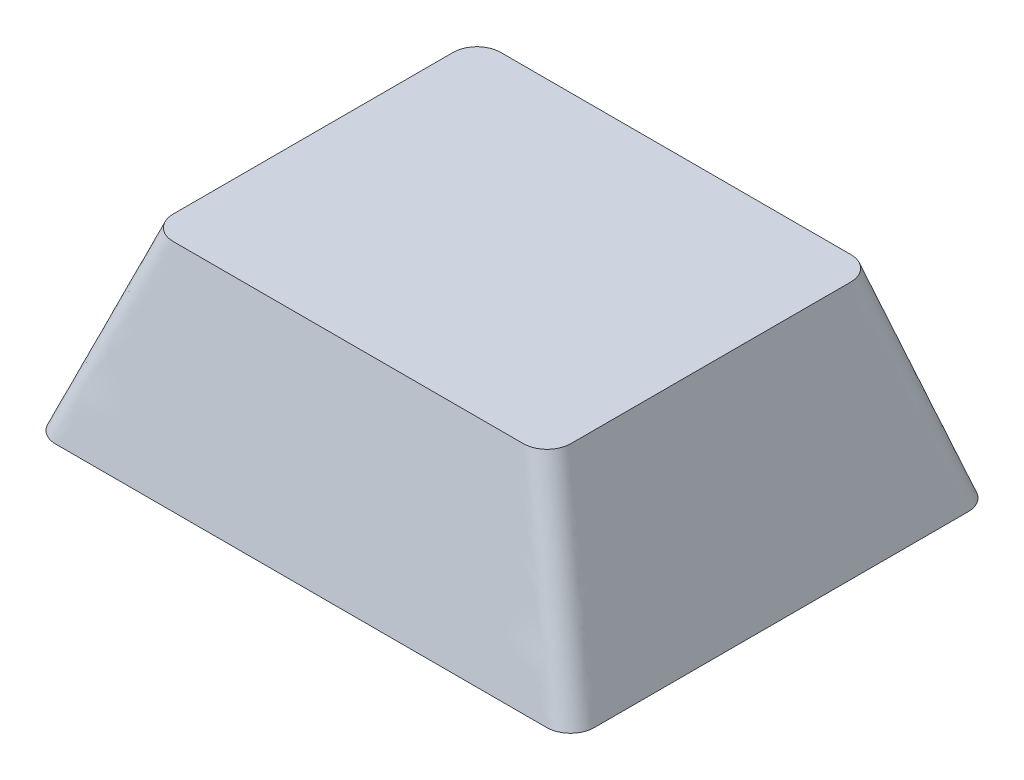
ISO-10303-21;
HEADER;
FILE_DESCRIPTION(('STEP AP214'),'2;1');
FILE_NAME('part.step','',(''),(''),'','','');
FILE_SCHEMA(('AUTOMOTIVE_DESIGN { 1 0 10303 214 1 1 1 1 }'));
ENDSEC;
DATA;
#1=APPLICATION_CONTEXT('core data for automotive mechanical design processes');
#2=APPLICATION_PROTOCOL_DEFINITION('international standard','automotive_design',2000,#1);
#3=PRODUCT_CONTEXT('',#1,'mechanical');
#4=PRODUCT('Part','Part','',(#3));
#5=PRODUCT_RELATED_PRODUCT_CATEGORY('part','',(#4));
#6=PRODUCT_DEFINITION_FORMATION('','',#4);
#7=PRODUCT_DEFINITION_CONTEXT('part definition',#1,'design');
#8=PRODUCT_DEFINITION('design','',#6,#7);
#9=PRODUCT_DEFINITION_SHAPE('','',#8);
#10=(LENGTH_UNIT() NAMED_UNIT(*) SI_UNIT(.MILLI.,.METRE.));
#11=(NAMED_UNIT(*) PLANE_ANGLE_UNIT() SI_UNIT($,.RADIAN.));
#12=(NAMED_UNIT(*) SI_UNIT($,.STERADIAN.) SOLID_ANGLE_UNIT());
#13=UNCERTAINTY_MEASURE_WITH_UNIT(LENGTH_MEASURE(1.E-05),#10,'distance_accuracy_value','');
#14=(GEOMETRIC_REPRESENTATION_CONTEXT(3) GLOBAL_UNCERTAINTY_ASSIGNED_CONTEXT((#13)) GLOBAL_UNIT_ASSIGNED_CONTEXT((#10,
#11,#12)) REPRESENTATION_CONTEXT('',''));
#15=CARTESIAN_POINT('',(0.,0.,0.));
#16=DIRECTION('',(0.,0.,1.));
#17=DIRECTION('',(1.,0.,0.));
#18=AXIS2_PLACEMENT_3D('',#15,#16,#17);
#19=CARTESIAN_POINT('',(-10.4902,0.,-7.9883));
#20=DIRECTION('',(0.,-1.,0.));
#21=DIRECTION('',(0.,0.,-1.));
#22=AXIS2_PLACEMENT_3D('',#19,#20,#21);
#23=PLANE('',#22);
#24=CARTESIAN_POINT('',(-10.4902,0.,-7.9883));
#25=DIRECTION('',(0.,1.,0.));
#26=DIRECTION('',(0.,0.,-1.));
#27=AXIS2_PLACEMENT_3D('',#24,#25,#26);
#28=CIRCLE('',#27,1.016);
#29=CARTESIAN_POINT('',(-10.4901999999044,0.,-9.0043));
#30=VERTEX_POINT('',#29);
#31=CARTESIAN_POINT('',(-11.5062,0.,-7.9883));
#32=VERTEX_POINT('',#31);
#33=EDGE_CURVE('E320',#30,#32,#28,.T.);
#34=ORIENTED_EDGE('',*,*,#33,.F.);
#35=DIRECTION('',(-1.,0.,0.));
#36=VECTOR('',#35,1.);
#37=CARTESIAN_POINT('',(-10.4902,0.,-9.0043));
#38=LINE('',#37,#36);
#39=CARTESIAN_POINT('',(10.4901999999955,0.,-9.0043));
#40=VERTEX_POINT('',#39);
#41=EDGE_CURVE('E568',#40,#30,#38,.T.);
#42=ORIENTED_EDGE('',*,*,#41,.F.);
#43=CARTESIAN_POINT('',(10.4902,0.,-7.9883));
#44=DIRECTION('',(0.,1.,0.));
#45=DIRECTION('',(0.,0.,-1.));
#46=AXIS2_PLACEMENT_3D('',#43,#44,#45);
#47=CIRCLE('',#46,1.016);
#48=CARTESIAN_POINT('',(11.5062,0.,-7.98829999995408));
#49=VERTEX_POINT('',#48);
#50=EDGE_CURVE('E558',#49,#40,#47,.T.);
#51=ORIENTED_EDGE('',*,*,#50,.F.);
#52=DIRECTION('',(0.,0.,-1.));
#53=VECTOR('',#52,1.);
#54=CARTESIAN_POINT('',(11.5062,0.,7.9883));
#55=LINE('',#54,#53);
#56=CARTESIAN_POINT('',(11.5062,0.,7.98829999999975));
#57=VERTEX_POINT('',#56);
#58=EDGE_CURVE('E548',#57,#49,#55,.T.);
#59=ORIENTED_EDGE('',*,*,#58,.F.);
#60=CARTESIAN_POINT('',(10.4902,0.,7.9883));
#61=DIRECTION('',(0.,1.,0.));
#62=DIRECTION('',(0.,0.,1.));
#63=AXIS2_PLACEMENT_3D('',#60,#61,#62);
#64=CIRCLE('',#63,1.016);
#65=CARTESIAN_POINT('',(10.4901999999046,0.,9.0043));
#66=VERTEX_POINT('',#65);
#67=EDGE_CURVE('E538',#66,#57,#64,.T.);
#68=ORIENTED_EDGE('',*,*,#67,.F.);
#69=DIRECTION('',(1.,0.,0.));
#70=VECTOR('',#69,1.);
#71=CARTESIAN_POINT('',(-10.4902,0.,9.0043));
#72=LINE('',#71,#70);
#73=CARTESIAN_POINT('',(-10.4901999999955,0.,9.0043));
#74=VERTEX_POINT('',#73);
#75=EDGE_CURVE('E531',#74,#66,#72,.T.);
#76=ORIENTED_EDGE('',*,*,#75,.F.);
#77=CARTESIAN_POINT('',(-10.4902,0.,7.9883));
#78=DIRECTION('',(0.,1.,0.));
#79=DIRECTION('',(0.,0.,-1.));
#80=AXIS2_PLACEMENT_3D('',#77,#78,#79);
#81=CIRCLE('',#80,1.016);
#82=CARTESIAN_POINT('',(-11.5062,0.,7.9883));
#83=VERTEX_POINT('',#82);
#84=EDGE_CURVE('E252',#83,#74,#81,.T.);
#85=ORIENTED_EDGE('',*,*,#84,.F.);
#86=DIRECTION('',(0.,0.,1.));
#87=VECTOR('',#86,1.);
#88=CARTESIAN_POINT('',(-11.5062,0.,7.9883));
#89=LINE('',#88,#87);
#90=EDGE_CURVE('E13',#32,#83,#89,.T.);
#91=ORIENTED_EDGE('',*,*,#90,.F.);
#92=EDGE_LOOP('',(#34,#42,#51,#59,#68,#76,#85,#91));
#93=FACE_BOUND('',#92,.T.);
#94=ADVANCED_FACE('F241',(#93),#23,.T.);
#95=CARTESIAN_POINT('',(7.48030000000001,8.001,-5.9817));
#96=DIRECTION('',(0.,-1.,0.));
#97=DIRECTION('',(0.,0.,-1.));
#98=AXIS2_PLACEMENT_3D('',#95,#96,#97);
#99=PLANE('',#98);
#100=CARTESIAN_POINT('',(7.48030000000001,8.001,-5.9817));
#101=DIRECTION('',(0.,1.,0.));
#102=DIRECTION('',(0.,0.,-1.));
#103=AXIS2_PLACEMENT_3D('',#100,#101,#102);
#104=CIRCLE('',#103,1.016);
#105=CARTESIAN_POINT('',(8.4963,8.001,-5.9817));
#106=VERTEX_POINT('',#105);
#107=CARTESIAN_POINT('',(7.48030000000001,8.001,-6.9977));
#108=VERTEX_POINT('',#107);
#109=EDGE_CURVE('E315',#106,#108,#104,.T.);
#110=ORIENTED_EDGE('',*,*,#109,.T.);
#111=DIRECTION('',(-1.,0.,0.));
#112=VECTOR('',#111,1.);
#113=CARTESIAN_POINT('',(-7.4803,8.001,-6.9977));
#114=LINE('',#113,#112);
#115=CARTESIAN_POINT('',(-7.4803,8.001,-6.9977));
#116=VERTEX_POINT('',#115);
#117=EDGE_CURVE('E307',#108,#116,#114,.T.);
#118=ORIENTED_EDGE('',*,*,#117,.T.);
#119=CARTESIAN_POINT('',(-7.4803,8.001,-5.9817));
#120=DIRECTION('',(0.,1.,0.));
#121=DIRECTION('',(0.,0.,-1.));
#122=AXIS2_PLACEMENT_3D('',#119,#120,#121);
#123=CIRCLE('',#122,1.016);
#124=CARTESIAN_POINT('',(-8.4963,8.001,-5.9817));
#125=VERTEX_POINT('',#124);
#126=EDGE_CURVE('E311',#116,#125,#123,.T.);
#127=ORIENTED_EDGE('',*,*,#126,.T.);
#128=DIRECTION('',(0.,0.,1.));
#129=VECTOR('',#128,1.);
#130=CARTESIAN_POINT('',(-8.4963,8.001,5.9817));
#131=LINE('',#130,#129);
#132=CARTESIAN_POINT('',(-8.4963,8.001,5.9817));
#133=VERTEX_POINT('',#132);
#134=EDGE_CURVE('E327',#125,#133,#131,.T.);
#135=ORIENTED_EDGE('',*,*,#134,.T.);
#136=CARTESIAN_POINT('',(-7.4803,8.001,5.9817));
#137=DIRECTION('',(0.,1.,0.));
#138=DIRECTION('',(0.,0.,-1.));
#139=AXIS2_PLACEMENT_3D('',#136,#137,#138);
#140=CIRCLE('',#139,1.016);
#141=CARTESIAN_POINT('',(-7.4803,8.001,6.99770000000001));
#142=VERTEX_POINT('',#141);
#143=EDGE_CURVE('E467',#133,#142,#140,.T.);
#144=ORIENTED_EDGE('',*,*,#143,.T.);
#145=DIRECTION('',(1.,0.,0.));
#146=VECTOR('',#145,1.);
#147=CARTESIAN_POINT('',(-7.4803,8.001,6.9977));
#148=LINE('',#147,#146);
#149=CARTESIAN_POINT('',(7.48030000000001,8.001,6.9977));
#150=VERTEX_POINT('',#149);
#151=EDGE_CURVE('E478',#142,#150,#148,.T.);
#152=ORIENTED_EDGE('',*,*,#151,.T.);
#153=CARTESIAN_POINT('',(7.48030000000001,8.001,5.9817));
#154=DIRECTION('',(0.,1.,0.));
#155=DIRECTION('',(0.,0.,1.));
#156=AXIS2_PLACEMENT_3D('',#153,#154,#155);
#157=CIRCLE('',#156,1.016);
#158=CARTESIAN_POINT('',(8.4963,8.001,5.9817));
#159=VERTEX_POINT('',#158);
#160=EDGE_CURVE('E481',#150,#159,#157,.T.);
#161=ORIENTED_EDGE('',*,*,#160,.T.);
#162=DIRECTION('',(0.,0.,-1.));
#163=VECTOR('',#162,1.);
#164=CARTESIAN_POINT('',(8.4963,8.001,5.9817));
#165=LINE('',#164,#163);
#166=EDGE_CURVE('E499',#159,#106,#165,.T.);
#167=ORIENTED_EDGE('',*,*,#166,.T.);
#168=EDGE_LOOP('',(#110,#118,#127,#135,#144,#152,#161,#167));
#169=FACE_BOUND('',#168,.T.);
#170=ADVANCED_FACE('F310',(#169),#99,.F.);
#171=CARTESIAN_POINT('',(-7.48029999931376,8.001,-6.9977));
#172=CARTESIAN_POINT('',(-10.4901999990643,0.,-9.0043));
#173=CARTESIAN_POINT('',(-6.21565225364385,8.001,-6.9977));
#174=CARTESIAN_POINT('',(-8.76573809378966,0.,-9.0043));
#175=CARTESIAN_POINT('',(-3.71381741296482,8.00100000000001,-6.99770000000001));
#176=CARTESIAN_POINT('',(-5.28169314327382,0.,-9.00430000000001));
#177=CARTESIAN_POINT('',(0.,8.00099999999999,-6.99769999999998));
#178=CARTESIAN_POINT('',(0.,0.,-9.00429999999998));
#179=CARTESIAN_POINT('',(3.71381741296483,8.00100000000002,-6.9977));
#180=CARTESIAN_POINT('',(5.28169314327382,0.,-9.00430000000001));
#181=CARTESIAN_POINT('',(6.21565225364386,8.001,-6.9977));
#182=CARTESIAN_POINT('',(8.76573809378966,0.,-9.0043));
#183=CARTESIAN_POINT('',(7.59536300856382,8.001,-6.9977));
#184=CARTESIAN_POINT('',(10.6470988484374,0.,-9.0043));
#185=CARTESIAN_POINT('',(7.84604196999697,8.00099999999999,-6.95872174506198));
#186=CARTESIAN_POINT('',(10.9163762661621,0.,-8.93647561188592));
#187=CARTESIAN_POINT('',(8.21645064881376,8.00100000000001,-6.72820280462431));
#188=CARTESIAN_POINT('',(11.2279867865086,0.,-8.71987013206253));
#189=CARTESIAN_POINT('',(8.45507469031479,8.00099999999999,-6.35676412863866));
#190=CARTESIAN_POINT('',(11.4411706449536,0.,-8.40758328156093));
#191=CARTESIAN_POINT('',(8.49630000000001,8.001,-6.09972227094651));
#192=CARTESIAN_POINT('',(11.5062,0.,-8.14125371743523));
#193=CARTESIAN_POINT('',(8.4963,8.001,-4.96977818271247));
#194=CARTESIAN_POINT('',(11.5062,0.,-6.67687629609514));
#195=CARTESIAN_POINT('',(8.49630000000001,8.00099999999999,-2.96888369305258));
#196=CARTESIAN_POINT('',(11.5062,0.,-4.02476420625089));
#197=CARTESIAN_POINT('',(8.49629999999999,8.00100000000002,0.));
#198=CARTESIAN_POINT('',(11.5062,0.,0.));
#199=CARTESIAN_POINT('',(8.49630000000001,8.00099999999999,2.96888369305258));
#200=CARTESIAN_POINT('',(11.5062,0.,4.02476420625089));
#201=CARTESIAN_POINT('',(8.4963,8.001,4.96977818271247));
#202=CARTESIAN_POINT('',(11.5062,0.,6.67687629609514));
#203=CARTESIAN_POINT('',(8.4963,8.001,6.09972227094652));
#204=CARTESIAN_POINT('',(11.5062,0.,8.14125371743522));
#205=CARTESIAN_POINT('',(8.4550746903148,8.001,6.35676412863867));
#206=CARTESIAN_POINT('',(11.4411706449536,0.,8.40758328156092));
#207=CARTESIAN_POINT('',(8.21645064881376,8.001,6.72820280462432));
#208=CARTESIAN_POINT('',(11.2279867865086,0.,8.71987013206254));
#209=CARTESIAN_POINT('',(7.84604196999698,8.001,6.95872174506199));
#210=CARTESIAN_POINT('',(10.9163762661621,0.,8.93647561188592));
#211=CARTESIAN_POINT('',(7.59536300856382,8.001,6.9977));
#212=CARTESIAN_POINT('',(10.6470988484374,0.,9.0043));
#213=CARTESIAN_POINT('',(6.21565225364386,8.001,6.9977));
#214=CARTESIAN_POINT('',(8.76573809378966,0.,9.0043));
#215=CARTESIAN_POINT('',(3.71381741296482,8.00100000000001,6.99770000000001));
#216=CARTESIAN_POINT('',(5.28169314327382,0.,9.0043));
#217=CARTESIAN_POINT('',(0.,8.00099999999999,6.9977));
#218=CARTESIAN_POINT('',(0.,0.,9.0043));
#219=CARTESIAN_POINT('',(-3.71381741296482,8.00100000000001,6.9977));
#220=CARTESIAN_POINT('',(-5.28169314327381,0.,9.0043));
#221=CARTESIAN_POINT('',(-6.21565225364385,8.001,6.9977));
#222=CARTESIAN_POINT('',(-8.76573809378966,0.,9.0043));
#223=CARTESIAN_POINT('',(-7.59536300856382,8.001,6.99770000000001));
#224=CARTESIAN_POINT('',(-10.6470988484374,0.,9.0043));
#225=CARTESIAN_POINT('',(-7.84604196999699,8.00100000000001,6.958721745062));
#226=CARTESIAN_POINT('',(-10.9163762661621,0.,8.9364756118859));
#227=CARTESIAN_POINT('',(-8.21645064881374,8.00099999999999,6.72820280462431));
#228=CARTESIAN_POINT('',(-11.2279867865086,0.,8.71987013206255));
#229=CARTESIAN_POINT('',(-8.45507469031479,8.001,6.35676412863867));
#230=CARTESIAN_POINT('',(-11.4411706449536,0.,8.40758328156092));
#231=CARTESIAN_POINT('',(-8.4963,8.001,6.09972227094652));
#232=CARTESIAN_POINT('',(-11.5062,0.,8.14125371743523));
#233=CARTESIAN_POINT('',(-8.4963,8.001,4.96977818271247));
#234=CARTESIAN_POINT('',(-11.5062,0.,6.67687629609514));
#235=CARTESIAN_POINT('',(-8.49629999999999,8.00100000000002,2.96888369305259));
#236=CARTESIAN_POINT('',(-11.5062,0.,4.02476420625089));
#237=CARTESIAN_POINT('',(-8.4963,8.00099999999998,0.));
#238=CARTESIAN_POINT('',(-11.5062,0.,0.));
#239=CARTESIAN_POINT('',(-8.4963,8.00100000000002,-2.96888369305257));
#240=CARTESIAN_POINT('',(-11.5062,0.,-4.02476420625088));
#241=CARTESIAN_POINT('',(-8.4963,8.001,-4.96977818271247));
#242=CARTESIAN_POINT('',(-11.5062,0.,-6.67687629609514));
#243=CARTESIAN_POINT('',(-8.4963,8.001,-6.09972227094651));
#244=CARTESIAN_POINT('',(-11.5062,0.,-8.14125371743523));
#245=CARTESIAN_POINT('',(-8.4550746903148,8.001,-6.35676412863867));
#246=CARTESIAN_POINT('',(-11.4411706449535,0.,-8.40758328156092));
#247=CARTESIAN_POINT('',(-8.21645064881375,8.001,-6.72820280462431));
#248=CARTESIAN_POINT('',(-11.2279867865086,0.,-8.71987013206254));
#249=CARTESIAN_POINT('',(-7.84604196999697,8.00099999999999,-6.958721745062));
#250=CARTESIAN_POINT('',(-10.9163762661621,0.,-8.93647561188592));
#251=CARTESIAN_POINT('',(-7.59536300856382,8.001,-6.9977));
#252=CARTESIAN_POINT('',(-10.6470988484374,0.,-9.0043));
#253=CARTESIAN_POINT('',(-7.48029999931376,8.001,-6.9977));
#254=CARTESIAN_POINT('',(-10.4901999990643,0.,-9.0043));
#255=B_SPLINE_SURFACE_WITH_KNOTS('',3,1,((#171,#172),(#173,#174),(#175,#176),(#177,#178),(#179,
#180),(#181,#182),(#183,#184),(#185,#186),(#187,#188),(#189,#190),(#191,#192),(#193,#194),(#195,
#196),(#197,#198),(#199,#200),(#201,#202),(#203,#204),(#205,#206),(#207,#208),(#209,#210),(#211,
#212),(#213,#214),(#215,#216),(#217,#218),(#219,#220),(#221,#222),(#223,#224),(#225,#226),(#227,
#228),(#229,#230),(#231,#232),(#233,#234),(#235,#236),(#237,#238),(#239,#240),(#241,#242),(#243,
#244),(#245,#246),(#247,#248),(#249,#250),(#251,#252),(#253,#254)),.UNSPECIFIED.,.T.,.F.,.F.,(4,
1,1,1,2,1,1,1,2,1,1,1,2,1,1,1,2,1,1,1,2,1,1,1,2,1,1,1,2,1,1,1,4),(2,2),(0.,0.0637083422763155,
0.127416684552631,0.191125026828946,0.254833369105262,0.26062982396927,0.266426278833278,
0.272222733697286,0.278019188561294,0.327717936556962,0.377416684552631,0.427115432548299,
0.476814180543968,0.482610635407976,0.488407090271984,0.494203545135992,0.5,0.563708342276315,
0.627416684552631,0.691125026828946,0.754833369105262,0.76062982396927,0.766426278833278,
0.772222733697286,0.778019188561294,0.827717936556962,0.877416684552631,0.927115432548299,
0.976814180543968,0.982610635407976,0.988407090271984,0.994203545135992,1.),(0.,1.),.UNSPECIFIED.);
#256=ORIENTED_EDGE('',*,*,#109,.F.);
#257=ORIENTED_EDGE('',*,*,#166,.F.);
#258=ORIENTED_EDGE('',*,*,#160,.F.);
#259=ORIENTED_EDGE('',*,*,#151,.F.);
#260=ORIENTED_EDGE('',*,*,#143,.F.);
#261=ORIENTED_EDGE('',*,*,#134,.F.);
#262=ORIENTED_EDGE('',*,*,#126,.F.);
#263=ORIENTED_EDGE('',*,*,#117,.F.);
#264=EDGE_LOOP('',(#256,#257,#258,#259,#260,#261,#262,#263));
#265=FACE_BOUND('',#264,.T.);
#266=ORIENTED_EDGE('',*,*,#90,.T.);
#267=ORIENTED_EDGE('',*,*,#84,.T.);
#268=ORIENTED_EDGE('',*,*,#75,.T.);
#269=ORIENTED_EDGE('',*,*,#67,.T.);
#270=ORIENTED_EDGE('',*,*,#58,.T.);
#271=ORIENTED_EDGE('',*,*,#50,.T.);
#272=ORIENTED_EDGE('',*,*,#41,.T.);
#273=ORIENTED_EDGE('',*,*,#33,.T.);
#274=EDGE_LOOP('',(#266,#267,#268,#269,#270,#271,#272,#273));
#275=FACE_BOUND('',#274,.T.);
#276=ADVANCED_FACE('F325',(#265,#275),#255,.T.);
#277=CLOSED_SHELL('',(#94,#170,#276));
#278=MANIFOLD_SOLID_BREP('B2',#277);
#279=ADVANCED_BREP_SHAPE_REPRESENTATION('',(#18,#278),#14);
#280=SHAPE_DEFINITION_REPRESENTATION(#9,#279);
ENDSEC;
END-ISO-10303-21;
